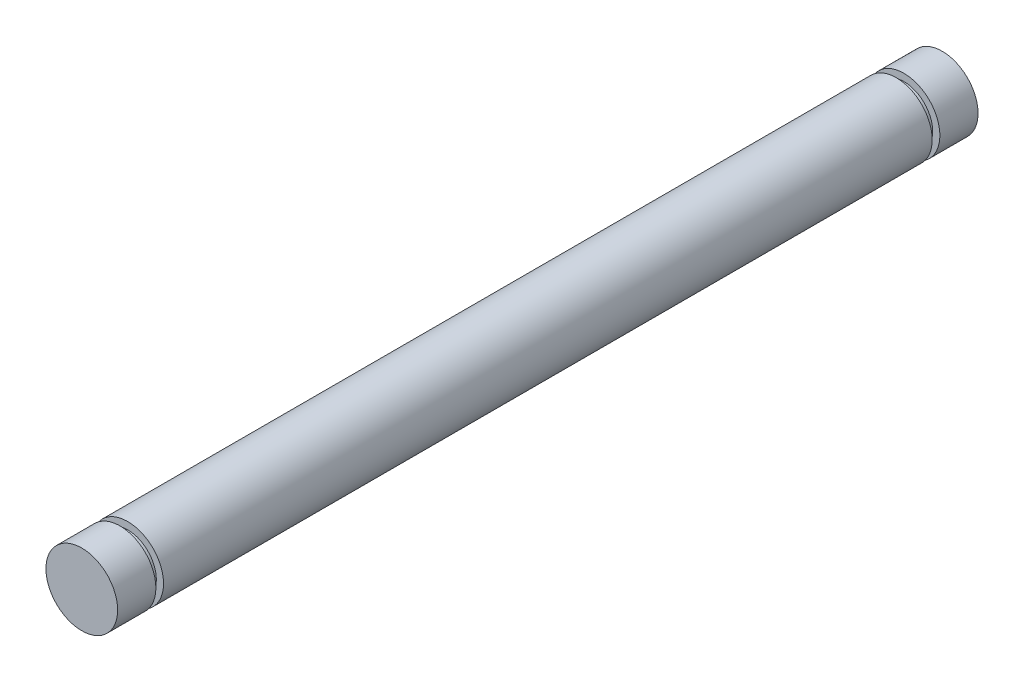
ISO-10303-21;
HEADER;
FILE_DESCRIPTION(('STEP AP214'),'2;1');
FILE_NAME('part.step','',(''),(''),'','','');
FILE_SCHEMA(('AUTOMOTIVE_DESIGN { 1 0 10303 214 1 1 1 1 }'));
ENDSEC;
DATA;
#1=APPLICATION_CONTEXT('core data for automotive mechanical design processes');
#2=APPLICATION_PROTOCOL_DEFINITION('international standard','automotive_design',2000,#1);
#3=PRODUCT_CONTEXT('',#1,'mechanical');
#4=PRODUCT('Part','Part','',(#3));
#5=PRODUCT_RELATED_PRODUCT_CATEGORY('part','',(#4));
#6=PRODUCT_DEFINITION_FORMATION('','',#4);
#7=PRODUCT_DEFINITION_CONTEXT('part definition',#1,'design');
#8=PRODUCT_DEFINITION('design','',#6,#7);
#9=PRODUCT_DEFINITION_SHAPE('','',#8);
#10=(LENGTH_UNIT() NAMED_UNIT(*) SI_UNIT(.MILLI.,.METRE.));
#11=(NAMED_UNIT(*) PLANE_ANGLE_UNIT() SI_UNIT($,.RADIAN.));
#12=(NAMED_UNIT(*) SI_UNIT($,.STERADIAN.) SOLID_ANGLE_UNIT());
#13=UNCERTAINTY_MEASURE_WITH_UNIT(LENGTH_MEASURE(1.E-05),#10,'distance_accuracy_value','');
#14=(GEOMETRIC_REPRESENTATION_CONTEXT(3) GLOBAL_UNCERTAINTY_ASSIGNED_CONTEXT((#13)) GLOBAL_UNIT_ASSIGNED_CONTEXT((#10,
#11,#12)) REPRESENTATION_CONTEXT('',''));
#15=CARTESIAN_POINT('',(0.,0.,0.));
#16=DIRECTION('',(0.,0.,1.));
#17=DIRECTION('',(1.,0.,0.));
#18=AXIS2_PLACEMENT_3D('',#15,#16,#17);
#19=CARTESIAN_POINT('',(0.,0.,102.108));
#20=DIRECTION('',(0.,0.,-1.));
#21=DIRECTION('',(-1.,0.,0.));
#22=AXIS2_PLACEMENT_3D('',#19,#20,#21);
#23=CYLINDRICAL_SURFACE('',#22,4.7625);
#24=CARTESIAN_POINT('',(0.,0.,102.108));
#25=DIRECTION('',(0.,0.,1.));
#26=DIRECTION('',(1.,0.,0.));
#27=AXIS2_PLACEMENT_3D('',#24,#25,#26);
#28=CIRCLE('',#27,4.7625);
#29=CARTESIAN_POINT('',(4.7625,0.,102.108));
#30=VERTEX_POINT('',#29);
#31=EDGE_CURVE('E57',#30,#30,#28,.T.);
#32=ORIENTED_EDGE('',*,*,#31,.F.);
#33=EDGE_LOOP('',(#32));
#34=FACE_BOUND('',#33,.T.);
#35=CARTESIAN_POINT('',(0.,0.,0.));
#36=DIRECTION('',(0.,0.,1.));
#37=DIRECTION('',(1.,0.,0.));
#38=AXIS2_PLACEMENT_3D('',#35,#36,#37);
#39=CIRCLE('',#38,4.7625);
#40=CARTESIAN_POINT('',(4.7625,0.,0.));
#41=VERTEX_POINT('',#40);
#42=EDGE_CURVE('E46',#41,#41,#39,.T.);
#43=ORIENTED_EDGE('',*,*,#42,.T.);
#44=EDGE_LOOP('',(#43));
#45=FACE_BOUND('',#44,.T.);
#46=ADVANCED_FACE('F43',(#34,#45),#23,.T.);
#47=CARTESIAN_POINT('',(0.,0.,102.108));
#48=DIRECTION('',(0.,0.,1.));
#49=DIRECTION('',(1.,0.,0.));
#50=AXIS2_PLACEMENT_3D('',#47,#48,#49);
#51=PLANE('',#50);
#52=CARTESIAN_POINT('',(0.,0.,102.108));
#53=DIRECTION('',(0.,0.,1.));
#54=DIRECTION('',(1.,0.,0.));
#55=AXIS2_PLACEMENT_3D('',#52,#53,#54);
#56=CIRCLE('',#55,3.81);
#57=CARTESIAN_POINT('',(3.81,0.,102.108));
#58=VERTEX_POINT('',#57);
#59=EDGE_CURVE('E10',#58,#58,#56,.T.);
#60=ORIENTED_EDGE('',*,*,#59,.F.);
#61=EDGE_LOOP('',(#60));
#62=FACE_BOUND('',#61,.T.);
#63=ORIENTED_EDGE('',*,*,#31,.T.);
#64=EDGE_LOOP('',(#63));
#65=FACE_BOUND('',#64,.T.);
#66=ADVANCED_FACE('F86',(#62,#65),#51,.T.);
#67=CARTESIAN_POINT('',(0.,0.,0.));
#68=DIRECTION('',(0.,0.,1.));
#69=DIRECTION('',(1.,0.,0.));
#70=AXIS2_PLACEMENT_3D('',#67,#68,#69);
#71=PLANE('',#70);
#72=CARTESIAN_POINT('',(0.,0.,0.));
#73=DIRECTION('',(0.,0.,-1.));
#74=DIRECTION('',(-1.,0.,0.));
#75=AXIS2_PLACEMENT_3D('',#72,#73,#74);
#76=CIRCLE('',#75,3.81);
#77=CARTESIAN_POINT('',(-3.81,0.,0.));
#78=VERTEX_POINT('',#77);
#79=EDGE_CURVE('E51',#78,#78,#76,.T.);
#80=ORIENTED_EDGE('',*,*,#79,.F.);
#81=EDGE_LOOP('',(#80));
#82=FACE_BOUND('',#81,.T.);
#83=ORIENTED_EDGE('',*,*,#42,.F.);
#84=EDGE_LOOP('',(#83));
#85=FACE_BOUND('',#84,.T.);
#86=ADVANCED_FACE('F83',(#82,#85),#71,.F.);
#87=CARTESIAN_POINT('',(0.,0.,-1.016));
#88=DIRECTION('',(0.,0.,1.));
#89=DIRECTION('',(1.,0.,0.));
#90=AXIS2_PLACEMENT_3D('',#87,#88,#89);
#91=CYLINDRICAL_SURFACE('',#90,3.81);
#92=CARTESIAN_POINT('',(0.,0.,-1.016));
#93=DIRECTION('',(0.,0.,-1.));
#94=DIRECTION('',(-1.,0.,0.));
#95=AXIS2_PLACEMENT_3D('',#92,#93,#94);
#96=CIRCLE('',#95,3.81);
#97=CARTESIAN_POINT('',(-3.81,0.,-1.016));
#98=VERTEX_POINT('',#97);
#99=EDGE_CURVE('E67',#98,#98,#96,.T.);
#100=ORIENTED_EDGE('',*,*,#99,.F.);
#101=EDGE_LOOP('',(#100));
#102=FACE_BOUND('',#101,.T.);
#103=ORIENTED_EDGE('',*,*,#79,.T.);
#104=EDGE_LOOP('',(#103));
#105=FACE_BOUND('',#104,.T.);
#106=ADVANCED_FACE('F85',(#102,#105),#91,.T.);
#107=CARTESIAN_POINT('',(0.,0.,-6.096));
#108=DIRECTION('',(0.,0.,1.));
#109=DIRECTION('',(1.,0.,0.));
#110=AXIS2_PLACEMENT_3D('',#107,#108,#109);
#111=CYLINDRICAL_SURFACE('',#110,4.7625);
#112=CARTESIAN_POINT('',(0.,0.,-6.096));
#113=DIRECTION('',(0.,0.,-1.));
#114=DIRECTION('',(-1.,0.,0.));
#115=AXIS2_PLACEMENT_3D('',#112,#113,#114);
#116=CIRCLE('',#115,4.7625);
#117=CARTESIAN_POINT('',(-4.7625,0.,-6.096));
#118=VERTEX_POINT('',#117);
#119=EDGE_CURVE('E63',#118,#118,#116,.T.);
#120=ORIENTED_EDGE('',*,*,#119,.F.);
#121=EDGE_LOOP('',(#120));
#122=FACE_BOUND('',#121,.T.);
#123=CARTESIAN_POINT('',(0.,0.,-1.016));
#124=DIRECTION('',(0.,0.,-1.));
#125=DIRECTION('',(-1.,0.,0.));
#126=AXIS2_PLACEMENT_3D('',#123,#124,#125);
#127=CIRCLE('',#126,4.7625);
#128=CARTESIAN_POINT('',(-4.7625,0.,-1.016));
#129=VERTEX_POINT('',#128);
#130=EDGE_CURVE('E68',#129,#129,#127,.T.);
#131=ORIENTED_EDGE('',*,*,#130,.T.);
#132=EDGE_LOOP('',(#131));
#133=FACE_BOUND('',#132,.T.);
#134=ADVANCED_FACE('F92',(#122,#133),#111,.T.);
#135=CARTESIAN_POINT('',(0.,0.,-6.096));
#136=DIRECTION('',(0.,0.,-1.));
#137=DIRECTION('',(-1.,0.,0.));
#138=AXIS2_PLACEMENT_3D('',#135,#136,#137);
#139=PLANE('',#138);
#140=ORIENTED_EDGE('',*,*,#119,.T.);
#141=EDGE_LOOP('',(#140));
#142=FACE_BOUND('',#141,.T.);
#143=ADVANCED_FACE('F130',(#142),#139,.T.);
#144=CARTESIAN_POINT('',(0.,0.,-1.016));
#145=DIRECTION('',(0.,0.,-1.));
#146=DIRECTION('',(-1.,0.,0.));
#147=AXIS2_PLACEMENT_3D('',#144,#145,#146);
#148=PLANE('',#147);
#149=ORIENTED_EDGE('',*,*,#99,.T.);
#150=EDGE_LOOP('',(#149));
#151=FACE_BOUND('',#150,.T.);
#152=ORIENTED_EDGE('',*,*,#130,.F.);
#153=EDGE_LOOP('',(#152));
#154=FACE_BOUND('',#153,.T.);
#155=ADVANCED_FACE('F140',(#151,#154),#148,.F.);
#156=CARTESIAN_POINT('',(0.,0.,103.124));
#157=DIRECTION('',(0.,0.,-1.));
#158=DIRECTION('',(-1.,0.,0.));
#159=AXIS2_PLACEMENT_3D('',#156,#157,#158);
#160=CYLINDRICAL_SURFACE('',#159,3.81);
#161=CARTESIAN_POINT('',(0.,0.,103.124));
#162=DIRECTION('',(0.,0.,1.));
#163=DIRECTION('',(1.,0.,0.));
#164=AXIS2_PLACEMENT_3D('',#161,#162,#163);
#165=CIRCLE('',#164,3.81);
#166=CARTESIAN_POINT('',(3.81,0.,103.124));
#167=VERTEX_POINT('',#166);
#168=EDGE_CURVE('E61',#167,#167,#165,.T.);
#169=ORIENTED_EDGE('',*,*,#168,.F.);
#170=EDGE_LOOP('',(#169));
#171=FACE_BOUND('',#170,.T.);
#172=ORIENTED_EDGE('',*,*,#59,.T.);
#173=EDGE_LOOP('',(#172));
#174=FACE_BOUND('',#173,.T.);
#175=ADVANCED_FACE('F149',(#171,#174),#160,.T.);
#176=CARTESIAN_POINT('',(0.,0.,108.204));
#177=DIRECTION('',(0.,0.,-1.));
#178=DIRECTION('',(-1.,0.,0.));
#179=AXIS2_PLACEMENT_3D('',#176,#177,#178);
#180=CYLINDRICAL_SURFACE('',#179,4.7625);
#181=CARTESIAN_POINT('',(0.,0.,108.204));
#182=DIRECTION('',(0.,0.,1.));
#183=DIRECTION('',(1.,0.,0.));
#184=AXIS2_PLACEMENT_3D('',#181,#182,#183);
#185=CIRCLE('',#184,4.7625);
#186=CARTESIAN_POINT('',(4.7625,0.,108.204));
#187=VERTEX_POINT('',#186);
#188=EDGE_CURVE('E199',#187,#187,#185,.T.);
#189=ORIENTED_EDGE('',*,*,#188,.F.);
#190=EDGE_LOOP('',(#189));
#191=FACE_BOUND('',#190,.T.);
#192=CARTESIAN_POINT('',(0.,0.,103.124));
#193=DIRECTION('',(0.,0.,1.));
#194=DIRECTION('',(1.,0.,0.));
#195=AXIS2_PLACEMENT_3D('',#192,#193,#194);
#196=CIRCLE('',#195,4.7625);
#197=CARTESIAN_POINT('',(4.7625,0.,103.124));
#198=VERTEX_POINT('',#197);
#199=EDGE_CURVE('E196',#198,#198,#196,.T.);
#200=ORIENTED_EDGE('',*,*,#199,.T.);
#201=EDGE_LOOP('',(#200));
#202=FACE_BOUND('',#201,.T.);
#203=ADVANCED_FACE('F158',(#191,#202),#180,.T.);
#204=CARTESIAN_POINT('',(0.,0.,108.204));
#205=DIRECTION('',(0.,0.,1.));
#206=DIRECTION('',(1.,0.,0.));
#207=AXIS2_PLACEMENT_3D('',#204,#205,#206);
#208=PLANE('',#207);
#209=ORIENTED_EDGE('',*,*,#188,.T.);
#210=EDGE_LOOP('',(#209));
#211=FACE_BOUND('',#210,.T.);
#212=ADVANCED_FACE('F168',(#211),#208,.T.);
#213=CARTESIAN_POINT('',(0.,0.,103.124));
#214=DIRECTION('',(0.,0.,1.));
#215=DIRECTION('',(1.,0.,0.));
#216=AXIS2_PLACEMENT_3D('',#213,#214,#215);
#217=PLANE('',#216);
#218=ORIENTED_EDGE('',*,*,#168,.T.);
#219=EDGE_LOOP('',(#218));
#220=FACE_BOUND('',#219,.T.);
#221=ORIENTED_EDGE('',*,*,#199,.F.);
#222=EDGE_LOOP('',(#221));
#223=FACE_BOUND('',#222,.T.);
#224=ADVANCED_FACE('F178',(#220,#223),#217,.F.);
#225=CLOSED_SHELL('',(#46,#66,#86,#106,#134,#143,#155,#175,#203,#212,#224));
#226=MANIFOLD_SOLID_BREP('B2',#225);
#227=ADVANCED_BREP_SHAPE_REPRESENTATION('',(#18,#226),#14);
#228=SHAPE_DEFINITION_REPRESENTATION(#9,#227);
ENDSEC;
END-ISO-10303-21;
